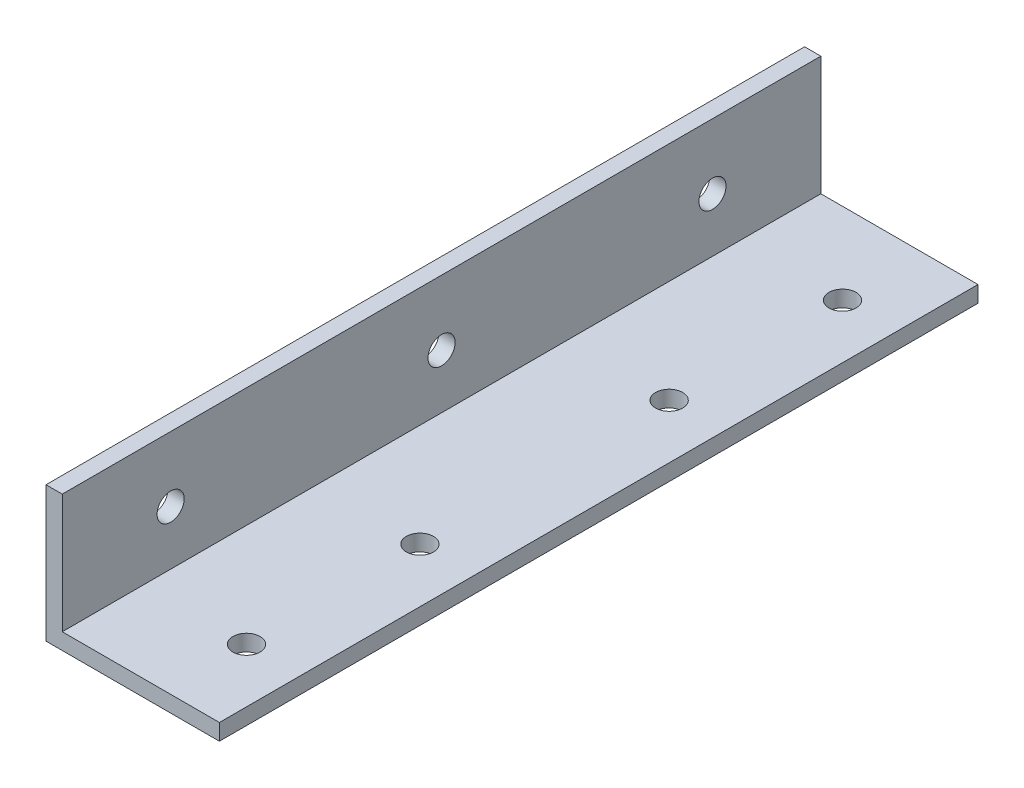
ISO-10303-21;
HEADER;
FILE_DESCRIPTION(('STEP AP214'),'2;1');
FILE_NAME('part.step','',(''),(''),'','','');
FILE_SCHEMA(('AUTOMOTIVE_DESIGN { 1 0 10303 214 1 1 1 1 }'));
ENDSEC;
DATA;
#1=APPLICATION_CONTEXT('core data for automotive mechanical design processes');
#2=APPLICATION_PROTOCOL_DEFINITION('international standard','automotive_design',2000,#1);
#3=PRODUCT_CONTEXT('',#1,'mechanical');
#4=PRODUCT('Part','Part','',(#3));
#5=PRODUCT_RELATED_PRODUCT_CATEGORY('part','',(#4));
#6=PRODUCT_DEFINITION_FORMATION('','',#4);
#7=PRODUCT_DEFINITION_CONTEXT('part definition',#1,'design');
#8=PRODUCT_DEFINITION('design','',#6,#7);
#9=PRODUCT_DEFINITION_SHAPE('','',#8);
#10=(LENGTH_UNIT() NAMED_UNIT(*) SI_UNIT(.MILLI.,.METRE.));
#11=(NAMED_UNIT(*) PLANE_ANGLE_UNIT() SI_UNIT($,.RADIAN.));
#12=(NAMED_UNIT(*) SI_UNIT($,.STERADIAN.) SOLID_ANGLE_UNIT());
#13=UNCERTAINTY_MEASURE_WITH_UNIT(LENGTH_MEASURE(1.E-05),#10,'distance_accuracy_value','');
#14=(GEOMETRIC_REPRESENTATION_CONTEXT(3) GLOBAL_UNCERTAINTY_ASSIGNED_CONTEXT((#13)) GLOBAL_UNIT_ASSIGNED_CONTEXT((#10,
#11,#12)) REPRESENTATION_CONTEXT('',''));
#15=CARTESIAN_POINT('',(0.,0.,0.));
#16=DIRECTION('',(0.,0.,1.));
#17=DIRECTION('',(1.,0.,0.));
#18=AXIS2_PLACEMENT_3D('',#15,#16,#17);
#19=CARTESIAN_POINT('',(-13.0379352477212,20.448337429217,140.));
#20=DIRECTION('',(0.,-1.,0.));
#21=DIRECTION('',(0.,0.,-1.));
#22=AXIS2_PLACEMENT_3D('',#19,#20,#21);
#23=PLANE('',#22);
#24=DIRECTION('',(-1.,0.,0.));
#25=VECTOR('',#24,1.);
#26=CARTESIAN_POINT('',(-13.0379352477212,20.448337429217,0.));
#27=LINE('',#26,#25);
#28=CARTESIAN_POINT('',(-10.0379352477212,20.448337429217,0.));
#29=VERTEX_POINT('',#28);
#30=CARTESIAN_POINT('',(-13.0379352477212,20.448337429217,0.));
#31=VERTEX_POINT('',#30);
#32=EDGE_CURVE('E119',#29,#31,#27,.T.);
#33=ORIENTED_EDGE('',*,*,#32,.T.);
#34=DIRECTION('',(0.,0.,-1.));
#35=VECTOR('',#34,1.);
#36=CARTESIAN_POINT('',(-13.0379352477212,20.448337429217,140.));
#37=LINE('',#36,#35);
#38=CARTESIAN_POINT('',(-13.0379352477212,20.448337429217,140.));
#39=VERTEX_POINT('',#38);
#40=EDGE_CURVE('E11',#39,#31,#37,.T.);
#41=ORIENTED_EDGE('',*,*,#40,.F.);
#42=DIRECTION('',(-1.,0.,0.));
#43=VECTOR('',#42,1.);
#44=CARTESIAN_POINT('',(-13.0379352477212,20.448337429217,140.));
#45=LINE('',#44,#43);
#46=CARTESIAN_POINT('',(-10.0379352477212,20.448337429217,140.));
#47=VERTEX_POINT('',#46);
#48=EDGE_CURVE('E130',#47,#39,#45,.T.);
#49=ORIENTED_EDGE('',*,*,#48,.F.);
#50=DIRECTION('',(0.,0.,-1.));
#51=VECTOR('',#50,1.);
#52=CARTESIAN_POINT('',(-10.0379352477212,20.448337429217,140.));
#53=LINE('',#52,#51);
#54=EDGE_CURVE('E115',#47,#29,#53,.T.);
#55=ORIENTED_EDGE('',*,*,#54,.T.);
#56=EDGE_LOOP('',(#33,#41,#49,#55));
#57=FACE_BOUND('',#56,.T.);
#58=ADVANCED_FACE('F35',(#57),#23,.F.);
#59=CARTESIAN_POINT('',(-13.0379352477212,-4.551662570783,140.));
#60=DIRECTION('',(1.,0.,0.));
#61=DIRECTION('',(0.,0.,-1.));
#62=AXIS2_PLACEMENT_3D('',#59,#60,#61);
#63=PLANE('',#62);
#64=CARTESIAN_POINT('',(-13.0379352477212,8.448337429217,20.));
#65=DIRECTION('',(1.,0.,0.));
#66=DIRECTION('',(0.,0.,-1.));
#67=AXIS2_PLACEMENT_3D('',#64,#65,#66);
#68=CIRCLE('',#67,2.5);
#69=CARTESIAN_POINT('',(-13.0379352477212,8.448337429217,17.5));
#70=VERTEX_POINT('',#69);
#71=EDGE_CURVE('E291',#70,#70,#68,.T.);
#72=ORIENTED_EDGE('',*,*,#71,.T.);
#73=EDGE_LOOP('',(#72));
#74=FACE_BOUND('',#73,.T.);
#75=CARTESIAN_POINT('',(-13.0379352477212,8.448337429217,70.));
#76=DIRECTION('',(1.,0.,0.));
#77=DIRECTION('',(0.,0.,-1.));
#78=AXIS2_PLACEMENT_3D('',#75,#76,#77);
#79=CIRCLE('',#78,2.5);
#80=CARTESIAN_POINT('',(-13.0379352477212,8.448337429217,67.5));
#81=VERTEX_POINT('',#80);
#82=EDGE_CURVE('E300',#81,#81,#79,.T.);
#83=ORIENTED_EDGE('',*,*,#82,.T.);
#84=EDGE_LOOP('',(#83));
#85=FACE_BOUND('',#84,.T.);
#86=CARTESIAN_POINT('',(-13.0379352477212,8.448337429217,120.));
#87=DIRECTION('',(1.,0.,0.));
#88=DIRECTION('',(0.,0.,-1.));
#89=AXIS2_PLACEMENT_3D('',#86,#87,#88);
#90=CIRCLE('',#89,2.5);
#91=CARTESIAN_POINT('',(-13.0379352477212,8.448337429217,117.5));
#92=VERTEX_POINT('',#91);
#93=EDGE_CURVE('E306',#92,#92,#90,.T.);
#94=ORIENTED_EDGE('',*,*,#93,.T.);
#95=EDGE_LOOP('',(#94));
#96=FACE_BOUND('',#95,.T.);
#97=DIRECTION('',(0.,-1.,0.));
#98=VECTOR('',#97,1.);
#99=CARTESIAN_POINT('',(-13.0379352477212,-4.551662570783,0.));
#100=LINE('',#99,#98);
#101=CARTESIAN_POINT('',(-13.0379352477212,-4.551662570783,0.));
#102=VERTEX_POINT('',#101);
#103=EDGE_CURVE('E122',#31,#102,#100,.T.);
#104=ORIENTED_EDGE('',*,*,#103,.T.);
#105=DIRECTION('',(0.,0.,-1.));
#106=VECTOR('',#105,1.);
#107=CARTESIAN_POINT('',(-13.0379352477212,-4.551662570783,140.));
#108=LINE('',#107,#106);
#109=CARTESIAN_POINT('',(-13.0379352477212,-4.551662570783,140.));
#110=VERTEX_POINT('',#109);
#111=EDGE_CURVE('E43',#110,#102,#108,.T.);
#112=ORIENTED_EDGE('',*,*,#111,.F.);
#113=DIRECTION('',(0.,-1.,0.));
#114=VECTOR('',#113,1.);
#115=CARTESIAN_POINT('',(-13.0379352477212,-4.551662570783,140.));
#116=LINE('',#115,#114);
#117=EDGE_CURVE('E88',#39,#110,#116,.T.);
#118=ORIENTED_EDGE('',*,*,#117,.F.);
#119=ORIENTED_EDGE('',*,*,#40,.T.);
#120=EDGE_LOOP('',(#104,#112,#118,#119));
#121=FACE_BOUND('',#120,.T.);
#122=ADVANCED_FACE('F160',(#74,#85,#96,#121),#63,.F.);
#123=CARTESIAN_POINT('',(18.9620647522788,-4.551662570783,140.));
#124=DIRECTION('',(0.,1.,0.));
#125=DIRECTION('',(-1.,0.,0.));
#126=AXIS2_PLACEMENT_3D('',#123,#124,#125);
#127=PLANE('',#126);
#128=CARTESIAN_POINT('',(8.9620647522788,-4.551662570783,15.));
#129=DIRECTION('',(0.,1.,0.));
#130=DIRECTION('',(0.,0.,1.));
#131=AXIS2_PLACEMENT_3D('',#128,#129,#130);
#132=CIRCLE('',#131,2.5);
#133=CARTESIAN_POINT('',(8.9620647522788,-4.551662570783,17.5));
#134=VERTEX_POINT('',#133);
#135=EDGE_CURVE('E312',#134,#134,#132,.T.);
#136=ORIENTED_EDGE('',*,*,#135,.T.);
#137=EDGE_LOOP('',(#136));
#138=FACE_BOUND('',#137,.T.);
#139=CARTESIAN_POINT('',(8.9620647522788,-4.551662570783,47.));
#140=DIRECTION('',(0.,1.,0.));
#141=DIRECTION('',(0.,0.,1.));
#142=AXIS2_PLACEMENT_3D('',#139,#140,#141);
#143=CIRCLE('',#142,2.5);
#144=CARTESIAN_POINT('',(8.9620647522788,-4.551662570783,49.5));
#145=VERTEX_POINT('',#144);
#146=EDGE_CURVE('E318',#145,#145,#143,.T.);
#147=ORIENTED_EDGE('',*,*,#146,.T.);
#148=EDGE_LOOP('',(#147));
#149=FACE_BOUND('',#148,.T.);
#150=CARTESIAN_POINT('',(8.9620647522788,-4.551662570783,93.));
#151=DIRECTION('',(0.,1.,0.));
#152=DIRECTION('',(0.,0.,1.));
#153=AXIS2_PLACEMENT_3D('',#150,#151,#152);
#154=CIRCLE('',#153,2.5);
#155=CARTESIAN_POINT('',(8.9620647522788,-4.551662570783,95.5));
#156=VERTEX_POINT('',#155);
#157=EDGE_CURVE('E324',#156,#156,#154,.T.);
#158=ORIENTED_EDGE('',*,*,#157,.T.);
#159=EDGE_LOOP('',(#158));
#160=FACE_BOUND('',#159,.T.);
#161=CARTESIAN_POINT('',(8.9620647522788,-4.551662570783,125.));
#162=DIRECTION('',(0.,1.,0.));
#163=DIRECTION('',(0.,0.,1.));
#164=AXIS2_PLACEMENT_3D('',#161,#162,#163);
#165=CIRCLE('',#164,2.5);
#166=CARTESIAN_POINT('',(8.9620647522788,-4.551662570783,127.5));
#167=VERTEX_POINT('',#166);
#168=EDGE_CURVE('E123',#167,#167,#165,.T.);
#169=ORIENTED_EDGE('',*,*,#168,.T.);
#170=EDGE_LOOP('',(#169));
#171=FACE_BOUND('',#170,.T.);
#172=DIRECTION('',(1.,0.,0.));
#173=VECTOR('',#172,1.);
#174=CARTESIAN_POINT('',(18.9620647522788,-4.551662570783,0.));
#175=LINE('',#174,#173);
#176=CARTESIAN_POINT('',(18.9620647522788,-4.551662570783,0.));
#177=VERTEX_POINT('',#176);
#178=EDGE_CURVE('E125',#102,#177,#175,.T.);
#179=ORIENTED_EDGE('',*,*,#178,.T.);
#180=DIRECTION('',(0.,0.,-1.));
#181=VECTOR('',#180,1.);
#182=CARTESIAN_POINT('',(18.9620647522788,-4.551662570783,140.));
#183=LINE('',#182,#181);
#184=CARTESIAN_POINT('',(18.9620647522788,-4.551662570783,140.));
#185=VERTEX_POINT('',#184);
#186=EDGE_CURVE('E110',#185,#177,#183,.T.);
#187=ORIENTED_EDGE('',*,*,#186,.F.);
#188=DIRECTION('',(1.,0.,0.));
#189=VECTOR('',#188,1.);
#190=CARTESIAN_POINT('',(18.9620647522788,-4.551662570783,140.));
#191=LINE('',#190,#189);
#192=EDGE_CURVE('E101',#110,#185,#191,.T.);
#193=ORIENTED_EDGE('',*,*,#192,.F.);
#194=ORIENTED_EDGE('',*,*,#111,.T.);
#195=EDGE_LOOP('',(#179,#187,#193,#194));
#196=FACE_BOUND('',#195,.T.);
#197=ADVANCED_FACE('F136',(#138,#149,#160,#171,#196),#127,.F.);
#198=CARTESIAN_POINT('',(18.9620647522788,-1.551662570783,140.));
#199=DIRECTION('',(-1.,0.,0.));
#200=DIRECTION('',(0.,0.,1.));
#201=AXIS2_PLACEMENT_3D('',#198,#199,#200);
#202=PLANE('',#201);
#203=DIRECTION('',(0.,1.,0.));
#204=VECTOR('',#203,1.);
#205=CARTESIAN_POINT('',(18.9620647522788,-1.551662570783,0.));
#206=LINE('',#205,#204);
#207=CARTESIAN_POINT('',(18.9620647522788,-1.551662570783,0.));
#208=VERTEX_POINT('',#207);
#209=EDGE_CURVE('E109',#177,#208,#206,.T.);
#210=ORIENTED_EDGE('',*,*,#209,.T.);
#211=DIRECTION('',(0.,0.,-1.));
#212=VECTOR('',#211,1.);
#213=CARTESIAN_POINT('',(18.9620647522788,-1.551662570783,140.));
#214=LINE('',#213,#212);
#215=CARTESIAN_POINT('',(18.9620647522788,-1.551662570783,140.));
#216=VERTEX_POINT('',#215);
#217=EDGE_CURVE('E106',#216,#208,#214,.T.);
#218=ORIENTED_EDGE('',*,*,#217,.F.);
#219=DIRECTION('',(0.,1.,0.));
#220=VECTOR('',#219,1.);
#221=CARTESIAN_POINT('',(18.9620647522788,-1.551662570783,140.));
#222=LINE('',#221,#220);
#223=EDGE_CURVE('E95',#185,#216,#222,.T.);
#224=ORIENTED_EDGE('',*,*,#223,.F.);
#225=ORIENTED_EDGE('',*,*,#186,.T.);
#226=EDGE_LOOP('',(#210,#218,#224,#225));
#227=FACE_BOUND('',#226,.T.);
#228=ADVANCED_FACE('F107',(#227),#202,.F.);
#229=CARTESIAN_POINT('',(-10.0379352477212,-1.551662570783,140.));
#230=DIRECTION('',(0.,-1.,0.));
#231=DIRECTION('',(0.,0.,-1.));
#232=AXIS2_PLACEMENT_3D('',#229,#230,#231);
#233=PLANE('',#232);
#234=CARTESIAN_POINT('',(8.9620647522788,-1.551662570783,15.));
#235=DIRECTION('',(0.,1.,0.));
#236=DIRECTION('',(0.,0.,1.));
#237=AXIS2_PLACEMENT_3D('',#234,#235,#236);
#238=CIRCLE('',#237,2.5);
#239=CARTESIAN_POINT('',(8.9620647522788,-1.551662570783,17.5));
#240=VERTEX_POINT('',#239);
#241=EDGE_CURVE('E309',#240,#240,#238,.T.);
#242=ORIENTED_EDGE('',*,*,#241,.F.);
#243=EDGE_LOOP('',(#242));
#244=FACE_BOUND('',#243,.T.);
#245=CARTESIAN_POINT('',(8.9620647522788,-1.551662570783,47.));
#246=DIRECTION('',(0.,1.,0.));
#247=DIRECTION('',(0.,0.,1.));
#248=AXIS2_PLACEMENT_3D('',#245,#246,#247);
#249=CIRCLE('',#248,2.5);
#250=CARTESIAN_POINT('',(8.9620647522788,-1.551662570783,49.5));
#251=VERTEX_POINT('',#250);
#252=EDGE_CURVE('E315',#251,#251,#249,.T.);
#253=ORIENTED_EDGE('',*,*,#252,.F.);
#254=EDGE_LOOP('',(#253));
#255=FACE_BOUND('',#254,.T.);
#256=CARTESIAN_POINT('',(8.9620647522788,-1.551662570783,93.));
#257=DIRECTION('',(0.,1.,0.));
#258=DIRECTION('',(0.,0.,1.));
#259=AXIS2_PLACEMENT_3D('',#256,#257,#258);
#260=CIRCLE('',#259,2.5);
#261=CARTESIAN_POINT('',(8.9620647522788,-1.551662570783,95.5));
#262=VERTEX_POINT('',#261);
#263=EDGE_CURVE('E321',#262,#262,#260,.T.);
#264=ORIENTED_EDGE('',*,*,#263,.F.);
#265=EDGE_LOOP('',(#264));
#266=FACE_BOUND('',#265,.T.);
#267=CARTESIAN_POINT('',(8.9620647522788,-1.551662570783,125.));
#268=DIRECTION('',(0.,1.,0.));
#269=DIRECTION('',(0.,0.,1.));
#270=AXIS2_PLACEMENT_3D('',#267,#268,#269);
#271=CIRCLE('',#270,2.5);
#272=CARTESIAN_POINT('',(8.9620647522788,-1.551662570783,127.5));
#273=VERTEX_POINT('',#272);
#274=EDGE_CURVE('E327',#273,#273,#271,.T.);
#275=ORIENTED_EDGE('',*,*,#274,.F.);
#276=EDGE_LOOP('',(#275));
#277=FACE_BOUND('',#276,.T.);
#278=DIRECTION('',(-1.,0.,0.));
#279=VECTOR('',#278,1.);
#280=CARTESIAN_POINT('',(-10.0379352477212,-1.551662570783,0.));
#281=LINE('',#280,#279);
#282=CARTESIAN_POINT('',(-10.0379352477212,-1.551662570783,0.));
#283=VERTEX_POINT('',#282);
#284=EDGE_CURVE('E74',#208,#283,#281,.T.);
#285=ORIENTED_EDGE('',*,*,#284,.T.);
#286=DIRECTION('',(0.,0.,-1.));
#287=VECTOR('',#286,1.);
#288=CARTESIAN_POINT('',(-10.0379352477212,-1.551662570783,140.));
#289=LINE('',#288,#287);
#290=CARTESIAN_POINT('',(-10.0379352477212,-1.551662570783,140.));
#291=VERTEX_POINT('',#290);
#292=EDGE_CURVE('E111',#291,#283,#289,.T.);
#293=ORIENTED_EDGE('',*,*,#292,.F.);
#294=DIRECTION('',(-1.,0.,0.));
#295=VECTOR('',#294,1.);
#296=CARTESIAN_POINT('',(-10.0379352477212,-1.551662570783,140.));
#297=LINE('',#296,#295);
#298=EDGE_CURVE('E99',#216,#291,#297,.T.);
#299=ORIENTED_EDGE('',*,*,#298,.F.);
#300=ORIENTED_EDGE('',*,*,#217,.T.);
#301=EDGE_LOOP('',(#285,#293,#299,#300));
#302=FACE_BOUND('',#301,.T.);
#303=ADVANCED_FACE('F113',(#244,#255,#266,#277,#302),#233,.F.);
#304=CARTESIAN_POINT('',(-10.0379352477212,20.448337429217,140.));
#305=DIRECTION('',(-1.,0.,0.));
#306=DIRECTION('',(0.,-1.,0.));
#307=AXIS2_PLACEMENT_3D('',#304,#305,#306);
#308=PLANE('',#307);
#309=CARTESIAN_POINT('',(-10.0379352477212,8.448337429217,20.));
#310=DIRECTION('',(1.,0.,0.));
#311=DIRECTION('',(0.,0.,-1.));
#312=AXIS2_PLACEMENT_3D('',#309,#310,#311);
#313=CIRCLE('',#312,2.5);
#314=CARTESIAN_POINT('',(-10.0379352477212,8.448337429217,17.5));
#315=VERTEX_POINT('',#314);
#316=EDGE_CURVE('E293',#315,#315,#313,.T.);
#317=ORIENTED_EDGE('',*,*,#316,.F.);
#318=EDGE_LOOP('',(#317));
#319=FACE_BOUND('',#318,.T.);
#320=CARTESIAN_POINT('',(-10.0379352477212,8.448337429217,70.));
#321=DIRECTION('',(1.,0.,0.));
#322=DIRECTION('',(0.,0.,-1.));
#323=AXIS2_PLACEMENT_3D('',#320,#321,#322);
#324=CIRCLE('',#323,2.5);
#325=CARTESIAN_POINT('',(-10.0379352477212,8.448337429217,67.5));
#326=VERTEX_POINT('',#325);
#327=EDGE_CURVE('E295',#326,#326,#324,.T.);
#328=ORIENTED_EDGE('',*,*,#327,.F.);
#329=EDGE_LOOP('',(#328));
#330=FACE_BOUND('',#329,.T.);
#331=CARTESIAN_POINT('',(-10.0379352477212,8.448337429217,120.));
#332=DIRECTION('',(1.,0.,0.));
#333=DIRECTION('',(0.,0.,-1.));
#334=AXIS2_PLACEMENT_3D('',#331,#332,#333);
#335=CIRCLE('',#334,2.5);
#336=CARTESIAN_POINT('',(-10.0379352477212,8.448337429217,117.5));
#337=VERTEX_POINT('',#336);
#338=EDGE_CURVE('E303',#337,#337,#335,.T.);
#339=ORIENTED_EDGE('',*,*,#338,.F.);
#340=EDGE_LOOP('',(#339));
#341=FACE_BOUND('',#340,.T.);
#342=DIRECTION('',(0.,1.,0.));
#343=VECTOR('',#342,1.);
#344=CARTESIAN_POINT('',(-10.0379352477212,20.448337429217,0.));
#345=LINE('',#344,#343);
#346=EDGE_CURVE('E80',#283,#29,#345,.T.);
#347=ORIENTED_EDGE('',*,*,#346,.T.);
#348=ORIENTED_EDGE('',*,*,#54,.F.);
#349=DIRECTION('',(0.,1.,0.));
#350=VECTOR('',#349,1.);
#351=CARTESIAN_POINT('',(-10.0379352477212,20.448337429217,140.));
#352=LINE('',#351,#350);
#353=EDGE_CURVE('E51',#291,#47,#352,.T.);
#354=ORIENTED_EDGE('',*,*,#353,.F.);
#355=ORIENTED_EDGE('',*,*,#292,.T.);
#356=EDGE_LOOP('',(#347,#348,#354,#355));
#357=FACE_BOUND('',#356,.T.);
#358=ADVANCED_FACE('F143',(#319,#330,#341,#357),#308,.F.);
#359=CARTESIAN_POINT('',(0.,0.,140.));
#360=DIRECTION('',(0.,0.,-1.));
#361=DIRECTION('',(-1.,0.,0.));
#362=AXIS2_PLACEMENT_3D('',#359,#360,#361);
#363=PLANE('',#362);
#364=ORIENTED_EDGE('',*,*,#48,.T.);
#365=ORIENTED_EDGE('',*,*,#117,.T.);
#366=ORIENTED_EDGE('',*,*,#192,.T.);
#367=ORIENTED_EDGE('',*,*,#223,.T.);
#368=ORIENTED_EDGE('',*,*,#298,.T.);
#369=ORIENTED_EDGE('',*,*,#353,.T.);
#370=EDGE_LOOP('',(#364,#365,#366,#367,#368,#369));
#371=FACE_BOUND('',#370,.T.);
#372=ADVANCED_FACE('F97',(#371),#363,.F.);
#373=CARTESIAN_POINT('',(0.,0.,0.));
#374=DIRECTION('',(0.,0.,-1.));
#375=DIRECTION('',(-1.,0.,0.));
#376=AXIS2_PLACEMENT_3D('',#373,#374,#375);
#377=PLANE('',#376);
#378=ORIENTED_EDGE('',*,*,#32,.F.);
#379=ORIENTED_EDGE('',*,*,#346,.F.);
#380=ORIENTED_EDGE('',*,*,#284,.F.);
#381=ORIENTED_EDGE('',*,*,#209,.F.);
#382=ORIENTED_EDGE('',*,*,#178,.F.);
#383=ORIENTED_EDGE('',*,*,#103,.F.);
#384=EDGE_LOOP('',(#378,#379,#380,#381,#382,#383));
#385=FACE_BOUND('',#384,.T.);
#386=ADVANCED_FACE('F139',(#385),#377,.T.);
#387=CARTESIAN_POINT('',(8.9620647522788,-1.551662570783,125.));
#388=DIRECTION('',(0.,1.,0.));
#389=DIRECTION('',(0.,0.,1.));
#390=AXIS2_PLACEMENT_3D('',#387,#388,#389);
#391=CYLINDRICAL_SURFACE('',#390,2.5);
#392=ORIENTED_EDGE('',*,*,#168,.F.);
#393=EDGE_LOOP('',(#392));
#394=FACE_BOUND('',#393,.T.);
#395=ORIENTED_EDGE('',*,*,#274,.T.);
#396=EDGE_LOOP('',(#395));
#397=FACE_BOUND('',#396,.T.);
#398=ADVANCED_FACE('F198',(#394,#397),#391,.F.);
#399=CARTESIAN_POINT('',(8.9620647522788,-1.551662570783,93.));
#400=DIRECTION('',(0.,1.,0.));
#401=DIRECTION('',(0.,0.,1.));
#402=AXIS2_PLACEMENT_3D('',#399,#400,#401);
#403=CYLINDRICAL_SURFACE('',#402,2.5);
#404=ORIENTED_EDGE('',*,*,#157,.F.);
#405=EDGE_LOOP('',(#404));
#406=FACE_BOUND('',#405,.T.);
#407=ORIENTED_EDGE('',*,*,#263,.T.);
#408=EDGE_LOOP('',(#407));
#409=FACE_BOUND('',#408,.T.);
#410=ADVANCED_FACE('F203',(#406,#409),#403,.F.);
#411=CARTESIAN_POINT('',(8.9620647522788,-1.551662570783,47.));
#412=DIRECTION('',(0.,1.,0.));
#413=DIRECTION('',(0.,0.,1.));
#414=AXIS2_PLACEMENT_3D('',#411,#412,#413);
#415=CYLINDRICAL_SURFACE('',#414,2.5);
#416=ORIENTED_EDGE('',*,*,#146,.F.);
#417=EDGE_LOOP('',(#416));
#418=FACE_BOUND('',#417,.T.);
#419=ORIENTED_EDGE('',*,*,#252,.T.);
#420=EDGE_LOOP('',(#419));
#421=FACE_BOUND('',#420,.T.);
#422=ADVANCED_FACE('F211',(#418,#421),#415,.F.);
#423=CARTESIAN_POINT('',(8.9620647522788,-1.551662570783,15.));
#424=DIRECTION('',(0.,1.,0.));
#425=DIRECTION('',(0.,0.,1.));
#426=AXIS2_PLACEMENT_3D('',#423,#424,#425);
#427=CYLINDRICAL_SURFACE('',#426,2.5);
#428=ORIENTED_EDGE('',*,*,#135,.F.);
#429=EDGE_LOOP('',(#428));
#430=FACE_BOUND('',#429,.T.);
#431=ORIENTED_EDGE('',*,*,#241,.T.);
#432=EDGE_LOOP('',(#431));
#433=FACE_BOUND('',#432,.T.);
#434=ADVANCED_FACE('F219',(#430,#433),#427,.F.);
#435=CARTESIAN_POINT('',(-10.0379352477212,8.448337429217,120.));
#436=DIRECTION('',(1.,0.,0.));
#437=DIRECTION('',(0.,0.,-1.));
#438=AXIS2_PLACEMENT_3D('',#435,#436,#437);
#439=CYLINDRICAL_SURFACE('',#438,2.5);
#440=ORIENTED_EDGE('',*,*,#93,.F.);
#441=EDGE_LOOP('',(#440));
#442=FACE_BOUND('',#441,.T.);
#443=ORIENTED_EDGE('',*,*,#338,.T.);
#444=EDGE_LOOP('',(#443));
#445=FACE_BOUND('',#444,.T.);
#446=ADVANCED_FACE('F226',(#442,#445),#439,.F.);
#447=CARTESIAN_POINT('',(-10.0379352477212,8.448337429217,70.));
#448=DIRECTION('',(1.,0.,0.));
#449=DIRECTION('',(0.,0.,-1.));
#450=AXIS2_PLACEMENT_3D('',#447,#448,#449);
#451=CYLINDRICAL_SURFACE('',#450,2.5);
#452=ORIENTED_EDGE('',*,*,#82,.F.);
#453=EDGE_LOOP('',(#452));
#454=FACE_BOUND('',#453,.T.);
#455=ORIENTED_EDGE('',*,*,#327,.T.);
#456=EDGE_LOOP('',(#455));
#457=FACE_BOUND('',#456,.T.);
#458=ADVANCED_FACE('F233',(#454,#457),#451,.F.);
#459=CARTESIAN_POINT('',(-10.0379352477212,8.448337429217,20.));
#460=DIRECTION('',(1.,0.,0.));
#461=DIRECTION('',(0.,0.,-1.));
#462=AXIS2_PLACEMENT_3D('',#459,#460,#461);
#463=CYLINDRICAL_SURFACE('',#462,2.5);
#464=ORIENTED_EDGE('',*,*,#71,.F.);
#465=EDGE_LOOP('',(#464));
#466=FACE_BOUND('',#465,.T.);
#467=ORIENTED_EDGE('',*,*,#316,.T.);
#468=EDGE_LOOP('',(#467));
#469=FACE_BOUND('',#468,.T.);
#470=ADVANCED_FACE('F241',(#466,#469),#463,.F.);
#471=CLOSED_SHELL('',(#58,#122,#197,#228,#303,#358,#372,#386,#398,#410,#422,#434,#446,#458,#470));
#472=MANIFOLD_SOLID_BREP('B2',#471);
#473=ADVANCED_BREP_SHAPE_REPRESENTATION('',(#18,#472),#14);
#474=SHAPE_DEFINITION_REPRESENTATION(#9,#473);
ENDSEC;
END-ISO-10303-21;
